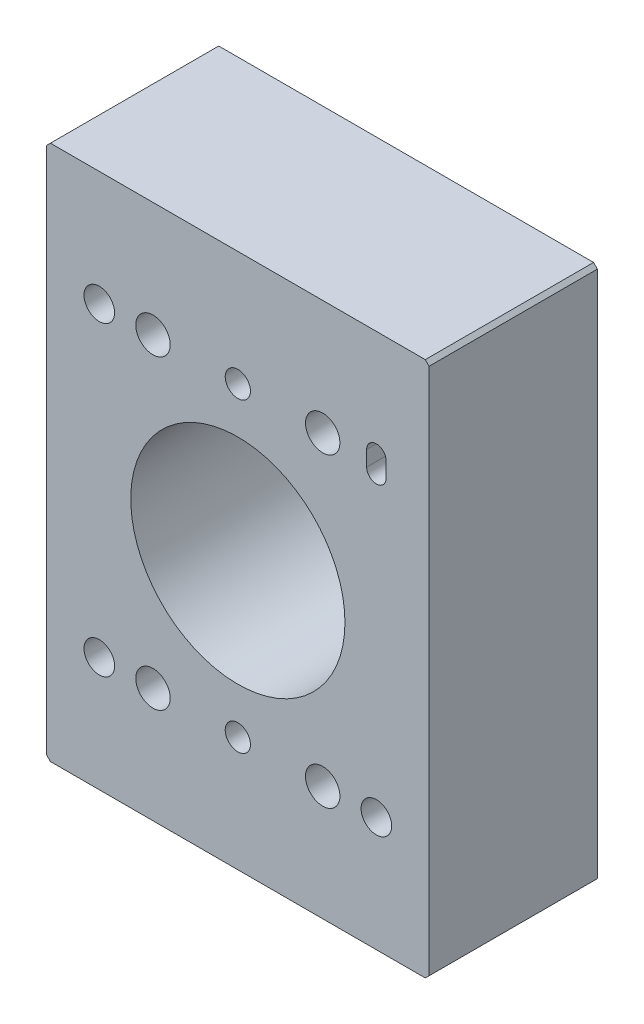
ISO-10303-21;
HEADER;
FILE_DESCRIPTION(('STEP AP214'),'2;1');
FILE_NAME('part.step','',(''),(''),'','','');
FILE_SCHEMA(('AUTOMOTIVE_DESIGN { 1 0 10303 214 1 1 1 1 }'));
ENDSEC;
DATA;
#1=APPLICATION_CONTEXT('core data for automotive mechanical design processes');
#2=APPLICATION_PROTOCOL_DEFINITION('international standard','automotive_design',2000,#1);
#3=PRODUCT_CONTEXT('',#1,'mechanical');
#4=PRODUCT('Part','Part','',(#3));
#5=PRODUCT_RELATED_PRODUCT_CATEGORY('part','',(#4));
#6=PRODUCT_DEFINITION_FORMATION('','',#4);
#7=PRODUCT_DEFINITION_CONTEXT('part definition',#1,'design');
#8=PRODUCT_DEFINITION('design','',#6,#7);
#9=PRODUCT_DEFINITION_SHAPE('','',#8);
#10=(LENGTH_UNIT() NAMED_UNIT(*) SI_UNIT(.MILLI.,.METRE.));
#11=(NAMED_UNIT(*) PLANE_ANGLE_UNIT() SI_UNIT($,.RADIAN.));
#12=(NAMED_UNIT(*) SI_UNIT($,.STERADIAN.) SOLID_ANGLE_UNIT());
#13=UNCERTAINTY_MEASURE_WITH_UNIT(LENGTH_MEASURE(1.E-05),#10,'distance_accuracy_value','');
#14=(GEOMETRIC_REPRESENTATION_CONTEXT(3) GLOBAL_UNCERTAINTY_ASSIGNED_CONTEXT((#13)) GLOBAL_UNIT_ASSIGNED_CONTEXT((#10,
#11,#12)) REPRESENTATION_CONTEXT('',''));
#15=CARTESIAN_POINT('',(0.,0.,0.));
#16=DIRECTION('',(0.,0.,1.));
#17=DIRECTION('',(1.,0.,0.));
#18=AXIS2_PLACEMENT_3D('',#15,#16,#17);
#19=CARTESIAN_POINT('',(0.,0.,22.));
#20=DIRECTION('',(0.,0.,1.));
#21=DIRECTION('',(1.,0.,0.));
#22=AXIS2_PLACEMENT_3D('',#19,#20,#21);
#23=PLANE('',#22);
#24=CARTESIAN_POINT('',(5.27842227378192,-0.544056224255018,22.));
#25=DIRECTION('',(0.,0.,1.));
#26=DIRECTION('',(1.,0.,0.));
#27=AXIS2_PLACEMENT_3D('',#24,#25,#26);
#28=CIRCLE('',#27,1.64999999999999);
#29=CARTESIAN_POINT('',(6.92842227378191,-0.544056224255018,22.));
#30=VERTEX_POINT('',#29);
#31=EDGE_CURVE('E505',#30,#30,#28,.T.);
#32=ORIENTED_EDGE('',*,*,#31,.F.);
#33=EDGE_LOOP('',(#32));
#34=FACE_BOUND('',#33,.T.);
#35=CARTESIAN_POINT('',(5.27842227378192,-40.544056224255,22.));
#36=DIRECTION('',(0.,0.,1.));
#37=DIRECTION('',(1.,0.,0.));
#38=AXIS2_PLACEMENT_3D('',#35,#36,#37);
#39=CIRCLE('',#38,1.64999999999999);
#40=CARTESIAN_POINT('',(6.92842227378191,-40.544056224255,22.));
#41=VERTEX_POINT('',#40);
#42=EDGE_CURVE('E507',#41,#41,#39,.T.);
#43=ORIENTED_EDGE('',*,*,#42,.F.);
#44=EDGE_LOOP('',(#43));
#45=FACE_BOUND('',#44,.T.);
#46=CARTESIAN_POINT('',(16.37030162413,-40.544056224255,22.));
#47=DIRECTION('',(0.,0.,1.));
#48=DIRECTION('',(1.,0.,0.));
#49=AXIS2_PLACEMENT_3D('',#46,#47,#48);
#50=CIRCLE('',#49,2.25);
#51=CARTESIAN_POINT('',(18.62030162413,-40.544056224255,22.));
#52=VERTEX_POINT('',#51);
#53=EDGE_CURVE('E522',#52,#52,#50,.T.);
#54=ORIENTED_EDGE('',*,*,#53,.F.);
#55=EDGE_LOOP('',(#54));
#56=FACE_BOUND('',#55,.T.);
#57=CARTESIAN_POINT('',(-12.8296983758701,-40.544056224255,22.));
#58=DIRECTION('',(0.,0.,1.));
#59=DIRECTION('',(-1.,0.,0.));
#60=AXIS2_PLACEMENT_3D('',#57,#58,#59);
#61=CIRCLE('',#60,2.);
#62=CARTESIAN_POINT('',(-14.8296983758701,-40.544056224255,22.));
#63=VERTEX_POINT('',#62);
#64=EDGE_CURVE('E159',#63,#63,#61,.T.);
#65=ORIENTED_EDGE('',*,*,#64,.F.);
#66=EDGE_LOOP('',(#65));
#67=FACE_BOUND('',#66,.T.);
#68=CARTESIAN_POINT('',(-5.81345707656614,-0.544056224255012,22.));
#69=DIRECTION('',(0.,0.,1.));
#70=DIRECTION('',(1.,0.,0.));
#71=AXIS2_PLACEMENT_3D('',#68,#69,#70);
#72=CIRCLE('',#71,2.25);
#73=CARTESIAN_POINT('',(-3.56345707656614,-0.544056224255012,22.));
#74=VERTEX_POINT('',#73);
#75=EDGE_CURVE('E176',#74,#74,#72,.T.);
#76=ORIENTED_EDGE('',*,*,#75,.F.);
#77=EDGE_LOOP('',(#76));
#78=FACE_BOUND('',#77,.T.);
#79=CARTESIAN_POINT('',(5.27842227378192,-20.544056224255,22.));
#80=DIRECTION('',(0.,0.,1.));
#81=DIRECTION('',(1.,0.,0.));
#82=AXIS2_PLACEMENT_3D('',#79,#80,#81);
#83=CIRCLE('',#82,14.);
#84=CARTESIAN_POINT('',(19.2784222737819,-20.544056224255,22.));
#85=VERTEX_POINT('',#84);
#86=EDGE_CURVE('E188',#85,#85,#83,.T.);
#87=ORIENTED_EDGE('',*,*,#86,.F.);
#88=EDGE_LOOP('',(#87));
#89=FACE_BOUND('',#88,.T.);
#90=DIRECTION('',(0.,-1.,0.));
#91=VECTOR('',#90,1.);
#92=CARTESIAN_POINT('',(-19.7215777262181,14.455943775745,22.));
#93=LINE('',#92,#91);
#94=CARTESIAN_POINT('',(-19.7215777262181,13.955943775745,22.));
#95=VERTEX_POINT('',#94);
#96=CARTESIAN_POINT('',(-19.7215777262181,-55.044056224255,22.));
#97=VERTEX_POINT('',#96);
#98=EDGE_CURVE('E194',#95,#97,#93,.T.);
#99=ORIENTED_EDGE('',*,*,#98,.T.);
#100=DIRECTION('',(-0.707106781186548,0.707106781186548,0.));
#101=VECTOR('',#100,1.);
#102=CARTESIAN_POINT('',(-37.3828169752366,-37.3828169752366,22.));
#103=LINE('',#102,#101);
#104=CARTESIAN_POINT('',(-19.2215777262181,-55.544056224255,22.));
#105=VERTEX_POINT('',#104);
#106=EDGE_CURVE('E237',#97,#105,#103,.F.);
#107=ORIENTED_EDGE('',*,*,#106,.T.);
#108=DIRECTION('',(1.,0.,0.));
#109=VECTOR('',#108,1.);
#110=CARTESIAN_POINT('',(-19.7215777262181,-55.544056224255,22.));
#111=LINE('',#110,#109);
#112=CARTESIAN_POINT('',(29.7784222737819,-55.544056224255,22.));
#113=VERTEX_POINT('',#112);
#114=EDGE_CURVE('E197',#105,#113,#111,.T.);
#115=ORIENTED_EDGE('',*,*,#114,.T.);
#116=DIRECTION('',(-0.70710678118655,-0.707106781186545,0.));
#117=VECTOR('',#116,1.);
#118=CARTESIAN_POINT('',(42.6612392490184,-42.6612392490187,22.));
#119=LINE('',#118,#117);
#120=CARTESIAN_POINT('',(30.2784222737819,-55.044056224255,22.));
#121=VERTEX_POINT('',#120);
#122=EDGE_CURVE('E235',#113,#121,#119,.F.);
#123=ORIENTED_EDGE('',*,*,#122,.T.);
#124=DIRECTION('',(0.,1.,0.));
#125=VECTOR('',#124,1.);
#126=CARTESIAN_POINT('',(30.2784222737819,14.455943775745,22.));
#127=LINE('',#126,#125);
#128=CARTESIAN_POINT('',(30.2784222737819,13.955943775745,22.));
#129=VERTEX_POINT('',#128);
#130=EDGE_CURVE('E201',#121,#129,#127,.T.);
#131=ORIENTED_EDGE('',*,*,#130,.T.);
#132=DIRECTION('',(0.707106781186545,-0.70710678118655,0.));
#133=VECTOR('',#132,1.);
#134=CARTESIAN_POINT('',(22.1171830247636,22.1171830247634,22.));
#135=LINE('',#134,#133);
#136=CARTESIAN_POINT('',(29.7784222737819,14.455943775745,22.));
#137=VERTEX_POINT('',#136);
#138=EDGE_CURVE('E56',#129,#137,#135,.F.);
#139=ORIENTED_EDGE('',*,*,#138,.T.);
#140=DIRECTION('',(-1.,0.,0.));
#141=VECTOR('',#140,1.);
#142=CARTESIAN_POINT('',(-19.7215777262181,14.455943775745,22.));
#143=LINE('',#142,#141);
#144=CARTESIAN_POINT('',(-19.2215777262181,14.455943775745,22.));
#145=VERTEX_POINT('',#144);
#146=EDGE_CURVE('E203',#137,#145,#143,.T.);
#147=ORIENTED_EDGE('',*,*,#146,.T.);
#148=DIRECTION('',(0.707106781186557,0.707106781186538,0.));
#149=VECTOR('',#148,1.);
#150=CARTESIAN_POINT('',(-16.8387607509813,16.8387607509817,22.));
#151=LINE('',#150,#149);
#152=EDGE_CURVE('E232',#145,#95,#151,.F.);
#153=ORIENTED_EDGE('',*,*,#152,.T.);
#154=EDGE_LOOP('',(#99,#107,#115,#123,#131,#139,#147,#153));
#155=FACE_BOUND('',#154,.T.);
#156=CARTESIAN_POINT('',(-12.8296983758701,-0.544056224255012,22.));
#157=DIRECTION('',(0.,0.,1.));
#158=DIRECTION('',(1.,0.,0.));
#159=AXIS2_PLACEMENT_3D('',#156,#157,#158);
#160=CIRCLE('',#159,2.);
#161=CARTESIAN_POINT('',(-10.8296983758701,-0.544056224255012,22.));
#162=VERTEX_POINT('',#161);
#163=EDGE_CURVE('E182',#162,#162,#160,.T.);
#164=ORIENTED_EDGE('',*,*,#163,.F.);
#165=EDGE_LOOP('',(#164));
#166=FACE_BOUND('',#165,.T.);
#167=CARTESIAN_POINT('',(-5.81345707656614,-40.544056224255,22.));
#168=DIRECTION('',(0.,0.,1.));
#169=DIRECTION('',(-1.,0.,0.));
#170=AXIS2_PLACEMENT_3D('',#167,#168,#169);
#171=CIRCLE('',#170,2.25);
#172=CARTESIAN_POINT('',(-8.06345707656613,-40.544056224255,22.));
#173=VERTEX_POINT('',#172);
#174=EDGE_CURVE('E170',#173,#173,#171,.T.);
#175=ORIENTED_EDGE('',*,*,#174,.F.);
#176=EDGE_LOOP('',(#175));
#177=FACE_BOUND('',#176,.T.);
#178=DIRECTION('',(0.,1.,0.));
#179=VECTOR('',#178,1.);
#180=CARTESIAN_POINT('',(24.6577196917629,0.455943775744988,22.));
#181=LINE('',#180,#179);
#182=CARTESIAN_POINT('',(24.6577196917629,-1.54405622425501,22.));
#183=VERTEX_POINT('',#182);
#184=CARTESIAN_POINT('',(24.6577196917629,0.455943775744988,22.));
#185=VERTEX_POINT('',#184);
#186=EDGE_CURVE('E136',#183,#185,#181,.T.);
#187=ORIENTED_EDGE('',*,*,#186,.F.);
#188=CARTESIAN_POINT('',(23.3865429234339,-1.54405622425501,22.));
#189=DIRECTION('',(0.,0.,1.));
#190=DIRECTION('',(1.,0.,0.));
#191=AXIS2_PLACEMENT_3D('',#188,#189,#190);
#192=CIRCLE('',#191,1.271176768329);
#193=CARTESIAN_POINT('',(22.1153661551049,-1.54405622425501,22.));
#194=VERTEX_POINT('',#193);
#195=EDGE_CURVE('E126',#194,#183,#192,.T.);
#196=ORIENTED_EDGE('',*,*,#195,.F.);
#197=DIRECTION('',(0.,-1.,0.));
#198=VECTOR('',#197,1.);
#199=CARTESIAN_POINT('',(22.1153661551049,0.455943775744988,22.));
#200=LINE('',#199,#198);
#201=CARTESIAN_POINT('',(22.1153661551049,0.455943775744988,22.));
#202=VERTEX_POINT('',#201);
#203=EDGE_CURVE('E152',#202,#194,#200,.T.);
#204=ORIENTED_EDGE('',*,*,#203,.F.);
#205=CARTESIAN_POINT('',(23.3865429234339,0.455943775744988,22.));
#206=DIRECTION('',(0.,0.,1.));
#207=DIRECTION('',(1.,0.,0.));
#208=AXIS2_PLACEMENT_3D('',#205,#206,#207);
#209=CIRCLE('',#208,1.271176768329);
#210=EDGE_CURVE('E150',#185,#202,#209,.T.);
#211=ORIENTED_EDGE('',*,*,#210,.F.);
#212=EDGE_LOOP('',(#187,#196,#204,#211));
#213=FACE_BOUND('',#212,.T.);
#214=CARTESIAN_POINT('',(23.3865429234339,-40.544056224255,22.));
#215=DIRECTION('',(0.,0.,1.));
#216=DIRECTION('',(1.,0.,0.));
#217=AXIS2_PLACEMENT_3D('',#214,#215,#216);
#218=CIRCLE('',#217,2.);
#219=CARTESIAN_POINT('',(25.3865429234339,-40.544056224255,22.));
#220=VERTEX_POINT('',#219);
#221=EDGE_CURVE('E528',#220,#220,#218,.T.);
#222=ORIENTED_EDGE('',*,*,#221,.F.);
#223=EDGE_LOOP('',(#222));
#224=FACE_BOUND('',#223,.T.);
#225=CARTESIAN_POINT('',(16.37030162413,-0.544056224255012,22.));
#226=DIRECTION('',(0.,0.,1.));
#227=DIRECTION('',(-1.,0.,0.));
#228=AXIS2_PLACEMENT_3D('',#225,#226,#227);
#229=CIRCLE('',#228,2.25);
#230=CARTESIAN_POINT('',(14.12030162413,-0.544056224255012,22.));
#231=VERTEX_POINT('',#230);
#232=EDGE_CURVE('E516',#231,#231,#229,.T.);
#233=ORIENTED_EDGE('',*,*,#232,.F.);
#234=EDGE_LOOP('',(#233));
#235=FACE_BOUND('',#234,.T.);
#236=ADVANCED_FACE('F35',(#34,#45,#56,#67,#78,#89,#155,#166,#177,#213,#224,#235),#23,.T.);
#237=CARTESIAN_POINT('',(0.,0.,0.));
#238=DIRECTION('',(0.,0.,1.));
#239=DIRECTION('',(1.,0.,0.));
#240=AXIS2_PLACEMENT_3D('',#237,#238,#239);
#241=PLANE('',#240);
#242=CARTESIAN_POINT('',(5.27842227378192,-0.544056224255018,0.));
#243=DIRECTION('',(0.,0.,1.));
#244=DIRECTION('',(1.,0.,0.));
#245=AXIS2_PLACEMENT_3D('',#242,#243,#244);
#246=CIRCLE('',#245,1.65);
#247=CARTESIAN_POINT('',(6.92842227378192,-0.544056224255018,0.));
#248=VERTEX_POINT('',#247);
#249=EDGE_CURVE('E503',#248,#248,#246,.T.);
#250=ORIENTED_EDGE('',*,*,#249,.T.);
#251=EDGE_LOOP('',(#250));
#252=FACE_BOUND('',#251,.T.);
#253=CARTESIAN_POINT('',(5.27842227378192,-40.544056224255,0.));
#254=DIRECTION('',(0.,0.,1.));
#255=DIRECTION('',(1.,0.,0.));
#256=AXIS2_PLACEMENT_3D('',#253,#254,#255);
#257=CIRCLE('',#256,1.65);
#258=CARTESIAN_POINT('',(6.92842227378192,-40.544056224255,0.));
#259=VERTEX_POINT('',#258);
#260=EDGE_CURVE('E512',#259,#259,#257,.T.);
#261=ORIENTED_EDGE('',*,*,#260,.T.);
#262=EDGE_LOOP('',(#261));
#263=FACE_BOUND('',#262,.T.);
#264=CARTESIAN_POINT('',(-5.81345707656614,-40.544056224255,0.));
#265=DIRECTION('',(0.,0.,1.));
#266=DIRECTION('',(-1.,0.,0.));
#267=AXIS2_PLACEMENT_3D('',#264,#265,#266);
#268=CIRCLE('',#267,2.25);
#269=CARTESIAN_POINT('',(-8.06345707656613,-40.544056224255,0.));
#270=VERTEX_POINT('',#269);
#271=EDGE_CURVE('E144',#270,#270,#268,.T.);
#272=ORIENTED_EDGE('',*,*,#271,.T.);
#273=EDGE_LOOP('',(#272));
#274=FACE_BOUND('',#273,.T.);
#275=CARTESIAN_POINT('',(-5.81345707656614,-0.544056224255012,0.));
#276=DIRECTION('',(0.,0.,1.));
#277=DIRECTION('',(1.,0.,0.));
#278=AXIS2_PLACEMENT_3D('',#275,#276,#277);
#279=CIRCLE('',#278,2.25);
#280=CARTESIAN_POINT('',(-3.56345707656614,-0.544056224255012,0.));
#281=VERTEX_POINT('',#280);
#282=EDGE_CURVE('E173',#281,#281,#279,.T.);
#283=ORIENTED_EDGE('',*,*,#282,.T.);
#284=EDGE_LOOP('',(#283));
#285=FACE_BOUND('',#284,.T.);
#286=CARTESIAN_POINT('',(-12.8296983758701,-0.544056224255012,0.));
#287=DIRECTION('',(0.,0.,1.));
#288=DIRECTION('',(1.,0.,0.));
#289=AXIS2_PLACEMENT_3D('',#286,#287,#288);
#290=CIRCLE('',#289,2.);
#291=CARTESIAN_POINT('',(-10.8296983758701,-0.544056224255012,0.));
#292=VERTEX_POINT('',#291);
#293=EDGE_CURVE('E179',#292,#292,#290,.T.);
#294=ORIENTED_EDGE('',*,*,#293,.T.);
#295=EDGE_LOOP('',(#294));
#296=FACE_BOUND('',#295,.T.);
#297=CARTESIAN_POINT('',(5.27842227378192,-20.544056224255,0.));
#298=DIRECTION('',(0.,0.,1.));
#299=DIRECTION('',(1.,0.,0.));
#300=AXIS2_PLACEMENT_3D('',#297,#298,#299);
#301=CIRCLE('',#300,14.);
#302=CARTESIAN_POINT('',(19.2784222737819,-20.544056224255,0.));
#303=VERTEX_POINT('',#302);
#304=EDGE_CURVE('E185',#303,#303,#301,.T.);
#305=ORIENTED_EDGE('',*,*,#304,.T.);
#306=EDGE_LOOP('',(#305));
#307=FACE_BOUND('',#306,.T.);
#308=DIRECTION('',(1.,0.,0.));
#309=VECTOR('',#308,1.);
#310=CARTESIAN_POINT('',(-19.7215777262181,-55.544056224255,0.));
#311=LINE('',#310,#309);
#312=CARTESIAN_POINT('',(-19.2215777262181,-55.544056224255,0.));
#313=VERTEX_POINT('',#312);
#314=CARTESIAN_POINT('',(29.7784222737819,-55.544056224255,0.));
#315=VERTEX_POINT('',#314);
#316=EDGE_CURVE('E208',#313,#315,#311,.T.);
#317=ORIENTED_EDGE('',*,*,#316,.F.);
#318=DIRECTION('',(0.707106781186548,-0.707106781186548,0.));
#319=VECTOR('',#318,1.);
#320=CARTESIAN_POINT('',(-19.2215777262181,-55.544056224255,0.));
#321=LINE('',#320,#319);
#322=CARTESIAN_POINT('',(-19.7215777262181,-55.044056224255,0.));
#323=VERTEX_POINT('',#322);
#324=EDGE_CURVE('E225',#313,#323,#321,.F.);
#325=ORIENTED_EDGE('',*,*,#324,.T.);
#326=DIRECTION('',(0.,-1.,0.));
#327=VECTOR('',#326,1.);
#328=CARTESIAN_POINT('',(-19.7215777262181,14.455943775745,0.));
#329=LINE('',#328,#327);
#330=CARTESIAN_POINT('',(-19.7215777262181,13.955943775745,0.));
#331=VERTEX_POINT('',#330);
#332=EDGE_CURVE('E191',#331,#323,#329,.T.);
#333=ORIENTED_EDGE('',*,*,#332,.F.);
#334=DIRECTION('',(-0.707106781186557,-0.707106781186538,0.));
#335=VECTOR('',#334,1.);
#336=CARTESIAN_POINT('',(-19.7215777262181,13.955943775745,0.));
#337=LINE('',#336,#335);
#338=CARTESIAN_POINT('',(-19.2215777262181,14.455943775745,0.));
#339=VERTEX_POINT('',#338);
#340=EDGE_CURVE('E219',#331,#339,#337,.F.);
#341=ORIENTED_EDGE('',*,*,#340,.T.);
#342=DIRECTION('',(-1.,0.,0.));
#343=VECTOR('',#342,1.);
#344=CARTESIAN_POINT('',(-19.7215777262181,14.455943775745,0.));
#345=LINE('',#344,#343);
#346=CARTESIAN_POINT('',(29.7784222737819,14.455943775745,0.));
#347=VERTEX_POINT('',#346);
#348=EDGE_CURVE('E198',#347,#339,#345,.T.);
#349=ORIENTED_EDGE('',*,*,#348,.F.);
#350=DIRECTION('',(-0.707106781186545,0.70710678118655,0.));
#351=VECTOR('',#350,1.);
#352=CARTESIAN_POINT('',(29.7784222737819,14.455943775745,0.));
#353=LINE('',#352,#351);
#354=CARTESIAN_POINT('',(30.2784222737819,13.955943775745,0.));
#355=VERTEX_POINT('',#354);
#356=EDGE_CURVE('E221',#347,#355,#353,.F.);
#357=ORIENTED_EDGE('',*,*,#356,.T.);
#358=DIRECTION('',(0.,1.,0.));
#359=VECTOR('',#358,1.);
#360=CARTESIAN_POINT('',(30.2784222737819,14.455943775745,0.));
#361=LINE('',#360,#359);
#362=CARTESIAN_POINT('',(30.2784222737819,-55.044056224255,0.));
#363=VERTEX_POINT('',#362);
#364=EDGE_CURVE('E211',#363,#355,#361,.T.);
#365=ORIENTED_EDGE('',*,*,#364,.F.);
#366=DIRECTION('',(0.70710678118655,0.707106781186545,0.));
#367=VECTOR('',#366,1.);
#368=CARTESIAN_POINT('',(30.2784222737819,-55.044056224255,0.));
#369=LINE('',#368,#367);
#370=EDGE_CURVE('E223',#363,#315,#369,.F.);
#371=ORIENTED_EDGE('',*,*,#370,.T.);
#372=EDGE_LOOP('',(#317,#325,#333,#341,#349,#357,#365,#371));
#373=FACE_BOUND('',#372,.T.);
#374=CARTESIAN_POINT('',(23.3865429234339,-1.54405622425501,0.));
#375=DIRECTION('',(0.,0.,1.));
#376=DIRECTION('',(1.,0.,0.));
#377=AXIS2_PLACEMENT_3D('',#374,#375,#376);
#378=CIRCLE('',#377,1.271176768329);
#379=CARTESIAN_POINT('',(22.1153661551049,-1.54405622425501,0.));
#380=VERTEX_POINT('',#379);
#381=CARTESIAN_POINT('',(24.6577196917629,-1.54405622425501,0.));
#382=VERTEX_POINT('',#381);
#383=EDGE_CURVE('E157',#380,#382,#378,.T.);
#384=ORIENTED_EDGE('',*,*,#383,.T.);
#385=DIRECTION('',(0.,1.,0.));
#386=VECTOR('',#385,1.);
#387=CARTESIAN_POINT('',(24.6577196917629,0.455943775744988,0.));
#388=LINE('',#387,#386);
#389=CARTESIAN_POINT('',(24.6577196917629,0.455943775744988,0.));
#390=VERTEX_POINT('',#389);
#391=EDGE_CURVE('E143',#382,#390,#388,.T.);
#392=ORIENTED_EDGE('',*,*,#391,.T.);
#393=CARTESIAN_POINT('',(23.3865429234339,0.455943775744988,0.));
#394=DIRECTION('',(0.,0.,1.));
#395=DIRECTION('',(1.,0.,0.));
#396=AXIS2_PLACEMENT_3D('',#393,#394,#395);
#397=CIRCLE('',#396,1.271176768329);
#398=CARTESIAN_POINT('',(22.1153661551049,0.455943775744988,0.));
#399=VERTEX_POINT('',#398);
#400=EDGE_CURVE('E161',#390,#399,#397,.T.);
#401=ORIENTED_EDGE('',*,*,#400,.T.);
#402=DIRECTION('',(0.,-1.,0.));
#403=VECTOR('',#402,1.);
#404=CARTESIAN_POINT('',(22.1153661551049,0.455943775744988,0.));
#405=LINE('',#404,#403);
#406=EDGE_CURVE('E137',#399,#380,#405,.T.);
#407=ORIENTED_EDGE('',*,*,#406,.T.);
#408=EDGE_LOOP('',(#384,#392,#401,#407));
#409=FACE_BOUND('',#408,.T.);
#410=CARTESIAN_POINT('',(-12.8296983758701,-40.544056224255,0.));
#411=DIRECTION('',(0.,0.,1.));
#412=DIRECTION('',(-1.,0.,0.));
#413=AXIS2_PLACEMENT_3D('',#410,#411,#412);
#414=CIRCLE('',#413,2.);
#415=CARTESIAN_POINT('',(-14.8296983758701,-40.544056224255,0.));
#416=VERTEX_POINT('',#415);
#417=EDGE_CURVE('E531',#416,#416,#414,.T.);
#418=ORIENTED_EDGE('',*,*,#417,.T.);
#419=EDGE_LOOP('',(#418));
#420=FACE_BOUND('',#419,.T.);
#421=CARTESIAN_POINT('',(23.3865429234339,-40.544056224255,0.));
#422=DIRECTION('',(0.,0.,1.));
#423=DIRECTION('',(1.,0.,0.));
#424=AXIS2_PLACEMENT_3D('',#421,#422,#423);
#425=CIRCLE('',#424,2.);
#426=CARTESIAN_POINT('',(25.3865429234339,-40.544056224255,0.));
#427=VERTEX_POINT('',#426);
#428=EDGE_CURVE('E525',#427,#427,#425,.T.);
#429=ORIENTED_EDGE('',*,*,#428,.T.);
#430=EDGE_LOOP('',(#429));
#431=FACE_BOUND('',#430,.T.);
#432=CARTESIAN_POINT('',(16.37030162413,-40.544056224255,0.));
#433=DIRECTION('',(0.,0.,1.));
#434=DIRECTION('',(1.,0.,0.));
#435=AXIS2_PLACEMENT_3D('',#432,#433,#434);
#436=CIRCLE('',#435,2.25);
#437=CARTESIAN_POINT('',(18.62030162413,-40.544056224255,0.));
#438=VERTEX_POINT('',#437);
#439=EDGE_CURVE('E519',#438,#438,#436,.T.);
#440=ORIENTED_EDGE('',*,*,#439,.T.);
#441=EDGE_LOOP('',(#440));
#442=FACE_BOUND('',#441,.T.);
#443=CARTESIAN_POINT('',(16.37030162413,-0.544056224255012,0.));
#444=DIRECTION('',(0.,0.,1.));
#445=DIRECTION('',(-1.,0.,0.));
#446=AXIS2_PLACEMENT_3D('',#443,#444,#445);
#447=CIRCLE('',#446,2.25);
#448=CARTESIAN_POINT('',(14.12030162413,-0.544056224255012,0.));
#449=VERTEX_POINT('',#448);
#450=EDGE_CURVE('E515',#449,#449,#447,.T.);
#451=ORIENTED_EDGE('',*,*,#450,.T.);
#452=EDGE_LOOP('',(#451));
#453=FACE_BOUND('',#452,.T.);
#454=ADVANCED_FACE('F253',(#252,#263,#274,#285,#296,#307,#373,#409,#420,#431,#442,#453),#241,.F.);
#455=CARTESIAN_POINT('',(-19.7215777262181,14.455943775745,22.));
#456=DIRECTION('',(1.,0.,0.));
#457=DIRECTION('',(0.,1.,0.));
#458=AXIS2_PLACEMENT_3D('',#455,#456,#457);
#459=PLANE('',#458);
#460=ORIENTED_EDGE('',*,*,#332,.T.);
#461=DIRECTION('',(0.,0.,1.));
#462=VECTOR('',#461,1.);
#463=CARTESIAN_POINT('',(-19.7215777262181,-55.044056224255,22.));
#464=LINE('',#463,#462);
#465=EDGE_CURVE('E230',#323,#97,#464,.T.);
#466=ORIENTED_EDGE('',*,*,#465,.T.);
#467=ORIENTED_EDGE('',*,*,#98,.F.);
#468=DIRECTION('',(0.,0.,-1.));
#469=VECTOR('',#468,1.);
#470=CARTESIAN_POINT('',(-19.7215777262181,13.955943775745,22.));
#471=LINE('',#470,#469);
#472=EDGE_CURVE('E227',#95,#331,#471,.T.);
#473=ORIENTED_EDGE('',*,*,#472,.T.);
#474=EDGE_LOOP('',(#460,#466,#467,#473));
#475=FACE_BOUND('',#474,.T.);
#476=ADVANCED_FACE('F267',(#475),#459,.F.);
#477=CARTESIAN_POINT('',(-19.7215777262181,-55.544056224255,22.));
#478=DIRECTION('',(0.,1.,0.));
#479=DIRECTION('',(0.,0.,1.));
#480=AXIS2_PLACEMENT_3D('',#477,#478,#479);
#481=PLANE('',#480);
#482=ORIENTED_EDGE('',*,*,#114,.F.);
#483=DIRECTION('',(0.,0.,-1.));
#484=VECTOR('',#483,1.);
#485=CARTESIAN_POINT('',(-19.2215777262181,-55.544056224255,22.));
#486=LINE('',#485,#484);
#487=EDGE_CURVE('E216',#105,#313,#486,.T.);
#488=ORIENTED_EDGE('',*,*,#487,.T.);
#489=ORIENTED_EDGE('',*,*,#316,.T.);
#490=DIRECTION('',(0.,0.,1.));
#491=VECTOR('',#490,1.);
#492=CARTESIAN_POINT('',(29.7784222737819,-55.544056224255,22.));
#493=LINE('',#492,#491);
#494=EDGE_CURVE('E205',#315,#113,#493,.T.);
#495=ORIENTED_EDGE('',*,*,#494,.T.);
#496=EDGE_LOOP('',(#482,#488,#489,#495));
#497=FACE_BOUND('',#496,.T.);
#498=ADVANCED_FACE('F275',(#497),#481,.F.);
#499=CARTESIAN_POINT('',(30.2784222737819,14.455943775745,22.));
#500=DIRECTION('',(-1.,0.,0.));
#501=DIRECTION('',(0.,-1.,0.));
#502=AXIS2_PLACEMENT_3D('',#499,#500,#501);
#503=PLANE('',#502);
#504=ORIENTED_EDGE('',*,*,#130,.F.);
#505=DIRECTION('',(0.,0.,-1.));
#506=VECTOR('',#505,1.);
#507=CARTESIAN_POINT('',(30.2784222737819,-55.044056224255,22.));
#508=LINE('',#507,#506);
#509=EDGE_CURVE('E241',#121,#363,#508,.T.);
#510=ORIENTED_EDGE('',*,*,#509,.T.);
#511=ORIENTED_EDGE('',*,*,#364,.T.);
#512=DIRECTION('',(0.,0.,1.));
#513=VECTOR('',#512,1.);
#514=CARTESIAN_POINT('',(30.2784222737819,13.955943775745,22.));
#515=LINE('',#514,#513);
#516=EDGE_CURVE('E239',#355,#129,#515,.T.);
#517=ORIENTED_EDGE('',*,*,#516,.T.);
#518=EDGE_LOOP('',(#504,#510,#511,#517));
#519=FACE_BOUND('',#518,.T.);
#520=ADVANCED_FACE('F247',(#519),#503,.F.);
#521=CARTESIAN_POINT('',(-19.7215777262181,14.455943775745,22.));
#522=DIRECTION('',(0.,-1.,0.));
#523=DIRECTION('',(0.,0.,-1.));
#524=AXIS2_PLACEMENT_3D('',#521,#522,#523);
#525=PLANE('',#524);
#526=ORIENTED_EDGE('',*,*,#146,.F.);
#527=DIRECTION('',(0.,0.,-1.));
#528=VECTOR('',#527,1.);
#529=CARTESIAN_POINT('',(29.7784222737819,14.455943775745,22.));
#530=LINE('',#529,#528);
#531=EDGE_CURVE('E11',#137,#347,#530,.T.);
#532=ORIENTED_EDGE('',*,*,#531,.T.);
#533=ORIENTED_EDGE('',*,*,#348,.T.);
#534=DIRECTION('',(0.,0.,1.));
#535=VECTOR('',#534,1.);
#536=CARTESIAN_POINT('',(-19.2215777262181,14.455943775745,22.));
#537=LINE('',#536,#535);
#538=EDGE_CURVE('E43',#339,#145,#537,.T.);
#539=ORIENTED_EDGE('',*,*,#538,.T.);
#540=EDGE_LOOP('',(#526,#532,#533,#539));
#541=FACE_BOUND('',#540,.T.);
#542=ADVANCED_FACE('F259',(#541),#525,.F.);
#543=CARTESIAN_POINT('',(5.27842227378192,-20.544056224255,22.));
#544=DIRECTION('',(0.,0.,-1.));
#545=DIRECTION('',(-1.,0.,0.));
#546=AXIS2_PLACEMENT_3D('',#543,#544,#545);
#547=CYLINDRICAL_SURFACE('',#546,14.);
#548=ORIENTED_EDGE('',*,*,#86,.T.);
#549=EDGE_LOOP('',(#548));
#550=FACE_BOUND('',#549,.T.);
#551=ORIENTED_EDGE('',*,*,#304,.F.);
#552=EDGE_LOOP('',(#551));
#553=FACE_BOUND('',#552,.T.);
#554=ADVANCED_FACE('F297',(#550,#553),#547,.F.);
#555=CARTESIAN_POINT('',(-12.8296983758701,-0.544056224255012,22.));
#556=DIRECTION('',(0.,0.,-1.));
#557=DIRECTION('',(-1.,0.,0.));
#558=AXIS2_PLACEMENT_3D('',#555,#556,#557);
#559=CYLINDRICAL_SURFACE('',#558,2.);
#560=ORIENTED_EDGE('',*,*,#163,.T.);
#561=EDGE_LOOP('',(#560));
#562=FACE_BOUND('',#561,.T.);
#563=ORIENTED_EDGE('',*,*,#293,.F.);
#564=EDGE_LOOP('',(#563));
#565=FACE_BOUND('',#564,.T.);
#566=ADVANCED_FACE('F330',(#562,#565),#559,.F.);
#567=CARTESIAN_POINT('',(-5.81345707656614,-0.544056224255012,22.));
#568=DIRECTION('',(0.,0.,-1.));
#569=DIRECTION('',(-1.,0.,0.));
#570=AXIS2_PLACEMENT_3D('',#567,#568,#569);
#571=CYLINDRICAL_SURFACE('',#570,2.25);
#572=ORIENTED_EDGE('',*,*,#75,.T.);
#573=EDGE_LOOP('',(#572));
#574=FACE_BOUND('',#573,.T.);
#575=ORIENTED_EDGE('',*,*,#282,.F.);
#576=EDGE_LOOP('',(#575));
#577=FACE_BOUND('',#576,.T.);
#578=ADVANCED_FACE('F337',(#574,#577),#571,.F.);
#579=CARTESIAN_POINT('',(-5.81345707656614,-40.544056224255,22.));
#580=DIRECTION('',(0.,0.,-1.));
#581=DIRECTION('',(-1.,0.,0.));
#582=AXIS2_PLACEMENT_3D('',#579,#580,#581);
#583=CYLINDRICAL_SURFACE('',#582,2.25);
#584=ORIENTED_EDGE('',*,*,#174,.T.);
#585=EDGE_LOOP('',(#584));
#586=FACE_BOUND('',#585,.T.);
#587=ORIENTED_EDGE('',*,*,#271,.F.);
#588=EDGE_LOOP('',(#587));
#589=FACE_BOUND('',#588,.T.);
#590=ADVANCED_FACE('F344',(#586,#589),#583,.F.);
#591=CARTESIAN_POINT('',(23.3865429234339,-1.54405622425501,22.));
#592=DIRECTION('',(0.,0.,-1.));
#593=DIRECTION('',(-1.,0.,0.));
#594=AXIS2_PLACEMENT_3D('',#591,#592,#593);
#595=CYLINDRICAL_SURFACE('',#594,1.271176768329);
#596=ORIENTED_EDGE('',*,*,#383,.F.);
#597=DIRECTION('',(0.,0.,-1.));
#598=VECTOR('',#597,1.);
#599=CARTESIAN_POINT('',(22.1153661551049,-1.54405622425501,22.));
#600=LINE('',#599,#598);
#601=EDGE_CURVE('E132',#194,#380,#600,.T.);
#602=ORIENTED_EDGE('',*,*,#601,.F.);
#603=ORIENTED_EDGE('',*,*,#195,.T.);
#604=DIRECTION('',(0.,0.,-1.));
#605=VECTOR('',#604,1.);
#606=CARTESIAN_POINT('',(24.6577196917629,-1.54405622425501,22.));
#607=LINE('',#606,#605);
#608=EDGE_CURVE('E129',#183,#382,#607,.T.);
#609=ORIENTED_EDGE('',*,*,#608,.T.);
#610=EDGE_LOOP('',(#596,#602,#603,#609));
#611=FACE_BOUND('',#610,.T.);
#612=ADVANCED_FACE('F128',(#611),#595,.F.);
#613=CARTESIAN_POINT('',(24.6577196917629,0.455943775744988,22.));
#614=DIRECTION('',(-1.,0.,0.));
#615=DIRECTION('',(0.,0.,1.));
#616=AXIS2_PLACEMENT_3D('',#613,#614,#615);
#617=PLANE('',#616);
#618=ORIENTED_EDGE('',*,*,#391,.F.);
#619=ORIENTED_EDGE('',*,*,#608,.F.);
#620=ORIENTED_EDGE('',*,*,#186,.T.);
#621=DIRECTION('',(0.,0.,-1.));
#622=VECTOR('',#621,1.);
#623=CARTESIAN_POINT('',(24.6577196917629,0.455943775744988,22.));
#624=LINE('',#623,#622);
#625=EDGE_CURVE('E145',#185,#390,#624,.T.);
#626=ORIENTED_EDGE('',*,*,#625,.T.);
#627=EDGE_LOOP('',(#618,#619,#620,#626));
#628=FACE_BOUND('',#627,.T.);
#629=ADVANCED_FACE('F140',(#628),#617,.T.);
#630=CARTESIAN_POINT('',(23.3865429234339,0.455943775744988,22.));
#631=DIRECTION('',(0.,0.,-1.));
#632=DIRECTION('',(-1.,0.,0.));
#633=AXIS2_PLACEMENT_3D('',#630,#631,#632);
#634=CYLINDRICAL_SURFACE('',#633,1.271176768329);
#635=ORIENTED_EDGE('',*,*,#400,.F.);
#636=ORIENTED_EDGE('',*,*,#625,.F.);
#637=ORIENTED_EDGE('',*,*,#210,.T.);
#638=DIRECTION('',(0.,0.,-1.));
#639=VECTOR('',#638,1.);
#640=CARTESIAN_POINT('',(22.1153661551049,0.455943775744988,22.));
#641=LINE('',#640,#639);
#642=EDGE_CURVE('E167',#202,#399,#641,.T.);
#643=ORIENTED_EDGE('',*,*,#642,.T.);
#644=EDGE_LOOP('',(#635,#636,#637,#643));
#645=FACE_BOUND('',#644,.T.);
#646=ADVANCED_FACE('F365',(#645),#634,.F.);
#647=CARTESIAN_POINT('',(22.1153661551049,0.455943775744988,22.));
#648=DIRECTION('',(1.,0.,0.));
#649=DIRECTION('',(0.,0.,-1.));
#650=AXIS2_PLACEMENT_3D('',#647,#648,#649);
#651=PLANE('',#650);
#652=ORIENTED_EDGE('',*,*,#406,.F.);
#653=ORIENTED_EDGE('',*,*,#642,.F.);
#654=ORIENTED_EDGE('',*,*,#203,.T.);
#655=ORIENTED_EDGE('',*,*,#601,.T.);
#656=EDGE_LOOP('',(#652,#653,#654,#655));
#657=FACE_BOUND('',#656,.T.);
#658=ADVANCED_FACE('F372',(#657),#651,.T.);
#659=CARTESIAN_POINT('',(-12.8296983758701,-40.544056224255,22.));
#660=DIRECTION('',(0.,0.,-1.));
#661=DIRECTION('',(-1.,0.,0.));
#662=AXIS2_PLACEMENT_3D('',#659,#660,#661);
#663=CYLINDRICAL_SURFACE('',#662,2.);
#664=ORIENTED_EDGE('',*,*,#64,.T.);
#665=EDGE_LOOP('',(#664));
#666=FACE_BOUND('',#665,.T.);
#667=ORIENTED_EDGE('',*,*,#417,.F.);
#668=EDGE_LOOP('',(#667));
#669=FACE_BOUND('',#668,.T.);
#670=ADVANCED_FACE('F380',(#666,#669),#663,.F.);
#671=CARTESIAN_POINT('',(23.3865429234339,-40.544056224255,22.));
#672=DIRECTION('',(0.,0.,-1.));
#673=DIRECTION('',(-1.,0.,0.));
#674=AXIS2_PLACEMENT_3D('',#671,#672,#673);
#675=CYLINDRICAL_SURFACE('',#674,2.);
#676=ORIENTED_EDGE('',*,*,#221,.T.);
#677=EDGE_LOOP('',(#676));
#678=FACE_BOUND('',#677,.T.);
#679=ORIENTED_EDGE('',*,*,#428,.F.);
#680=EDGE_LOOP('',(#679));
#681=FACE_BOUND('',#680,.T.);
#682=ADVANCED_FACE('F388',(#678,#681),#675,.F.);
#683=CARTESIAN_POINT('',(16.37030162413,-40.544056224255,22.));
#684=DIRECTION('',(0.,0.,-1.));
#685=DIRECTION('',(-1.,0.,0.));
#686=AXIS2_PLACEMENT_3D('',#683,#684,#685);
#687=CYLINDRICAL_SURFACE('',#686,2.25);
#688=ORIENTED_EDGE('',*,*,#53,.T.);
#689=EDGE_LOOP('',(#688));
#690=FACE_BOUND('',#689,.T.);
#691=ORIENTED_EDGE('',*,*,#439,.F.);
#692=EDGE_LOOP('',(#691));
#693=FACE_BOUND('',#692,.T.);
#694=ADVANCED_FACE('F396',(#690,#693),#687,.F.);
#695=CARTESIAN_POINT('',(16.37030162413,-0.544056224255012,22.));
#696=DIRECTION('',(0.,0.,-1.));
#697=DIRECTION('',(-1.,0.,0.));
#698=AXIS2_PLACEMENT_3D('',#695,#696,#697);
#699=CYLINDRICAL_SURFACE('',#698,2.25);
#700=ORIENTED_EDGE('',*,*,#232,.T.);
#701=EDGE_LOOP('',(#700));
#702=FACE_BOUND('',#701,.T.);
#703=ORIENTED_EDGE('',*,*,#450,.F.);
#704=EDGE_LOOP('',(#703));
#705=FACE_BOUND('',#704,.T.);
#706=ADVANCED_FACE('F404',(#702,#705),#699,.F.);
#707=CARTESIAN_POINT('',(5.27842227378192,-40.544056224255,22.));
#708=DIRECTION('',(0.,0.,1.));
#709=DIRECTION('',(1.,0.,0.));
#710=AXIS2_PLACEMENT_3D('',#707,#708,#709);
#711=CYLINDRICAL_SURFACE('',#710,1.64999999999999);
#712=ORIENTED_EDGE('',*,*,#260,.F.);
#713=EDGE_LOOP('',(#712));
#714=FACE_BOUND('',#713,.T.);
#715=ORIENTED_EDGE('',*,*,#42,.T.);
#716=EDGE_LOOP('',(#715));
#717=FACE_BOUND('',#716,.T.);
#718=ADVANCED_FACE('F412',(#714,#717),#711,.F.);
#719=CARTESIAN_POINT('',(5.27842227378192,-0.544056224255018,22.));
#720=DIRECTION('',(0.,0.,1.));
#721=DIRECTION('',(1.,0.,0.));
#722=AXIS2_PLACEMENT_3D('',#719,#720,#721);
#723=CYLINDRICAL_SURFACE('',#722,1.64999999999999);
#724=ORIENTED_EDGE('',*,*,#249,.F.);
#725=EDGE_LOOP('',(#724));
#726=FACE_BOUND('',#725,.T.);
#727=ORIENTED_EDGE('',*,*,#31,.T.);
#728=EDGE_LOOP('',(#727));
#729=FACE_BOUND('',#728,.T.);
#730=ADVANCED_FACE('F284',(#726,#729),#723,.F.);
#731=CARTESIAN_POINT('',(-19.2215777262181,-55.544056224255,22.));
#732=DIRECTION('',(0.707106781186547,0.707106781186547,0.));
#733=DIRECTION('',(0.,0.,-1.));
#734=AXIS2_PLACEMENT_3D('',#731,#732,#733);
#735=PLANE('',#734);
#736=ORIENTED_EDGE('',*,*,#106,.F.);
#737=ORIENTED_EDGE('',*,*,#465,.F.);
#738=ORIENTED_EDGE('',*,*,#324,.F.);
#739=ORIENTED_EDGE('',*,*,#487,.F.);
#740=EDGE_LOOP('',(#736,#737,#738,#739));
#741=FACE_BOUND('',#740,.T.);
#742=ADVANCED_FACE('F272',(#741),#735,.F.);
#743=CARTESIAN_POINT('',(30.2784222737819,-55.044056224255,22.));
#744=DIRECTION('',(-0.707106781186545,0.70710678118655,0.));
#745=DIRECTION('',(0.,0.,-1.));
#746=AXIS2_PLACEMENT_3D('',#743,#744,#745);
#747=PLANE('',#746);
#748=ORIENTED_EDGE('',*,*,#122,.F.);
#749=ORIENTED_EDGE('',*,*,#494,.F.);
#750=ORIENTED_EDGE('',*,*,#370,.F.);
#751=ORIENTED_EDGE('',*,*,#509,.F.);
#752=EDGE_LOOP('',(#748,#749,#750,#751));
#753=FACE_BOUND('',#752,.T.);
#754=ADVANCED_FACE('F277',(#753),#747,.F.);
#755=CARTESIAN_POINT('',(29.7784222737819,14.455943775745,22.));
#756=DIRECTION('',(-0.70710678118655,-0.707106781186545,0.));
#757=DIRECTION('',(0.,0.,-1.));
#758=AXIS2_PLACEMENT_3D('',#755,#756,#757);
#759=PLANE('',#758);
#760=ORIENTED_EDGE('',*,*,#138,.F.);
#761=ORIENTED_EDGE('',*,*,#516,.F.);
#762=ORIENTED_EDGE('',*,*,#356,.F.);
#763=ORIENTED_EDGE('',*,*,#531,.F.);
#764=EDGE_LOOP('',(#760,#761,#762,#763));
#765=FACE_BOUND('',#764,.T.);
#766=ADVANCED_FACE('F258',(#765),#759,.F.);
#767=CARTESIAN_POINT('',(-19.7215777262181,13.955943775745,22.));
#768=DIRECTION('',(0.707106781186538,-0.707106781186557,0.));
#769=DIRECTION('',(0.,0.,-1.));
#770=AXIS2_PLACEMENT_3D('',#767,#768,#769);
#771=PLANE('',#770);
#772=ORIENTED_EDGE('',*,*,#152,.F.);
#773=ORIENTED_EDGE('',*,*,#538,.F.);
#774=ORIENTED_EDGE('',*,*,#340,.F.);
#775=ORIENTED_EDGE('',*,*,#472,.F.);
#776=EDGE_LOOP('',(#772,#773,#774,#775));
#777=FACE_BOUND('',#776,.T.);
#778=ADVANCED_FACE('F37',(#777),#771,.F.);
#779=CLOSED_SHELL('',(#236,#454,#476,#498,#520,#542,#554,#566,#578,#590,#612,#629,#646,#658,
#670,#682,#694,#706,#718,#730,#742,#754,#766,#778));
#780=MANIFOLD_SOLID_BREP('B2',#779);
#781=ADVANCED_BREP_SHAPE_REPRESENTATION('',(#18,#780),#14);
#782=SHAPE_DEFINITION_REPRESENTATION(#9,#781);
ENDSEC;
END-ISO-10303-21;
